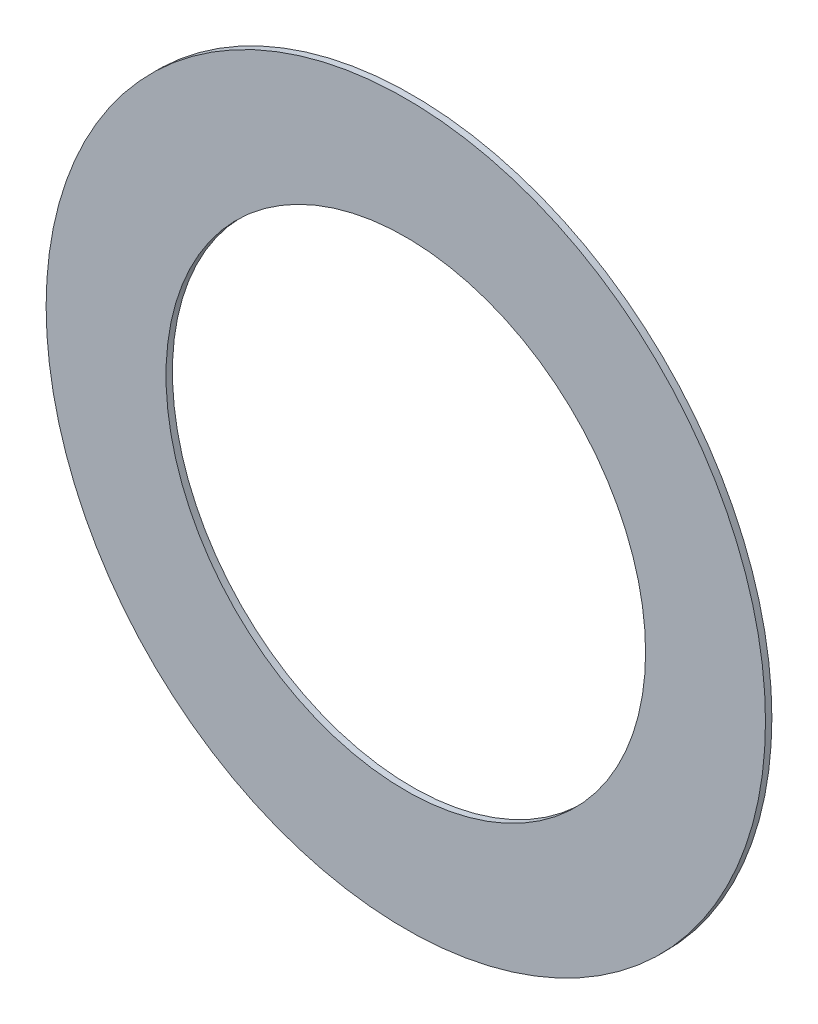
ISO-10303-21;
HEADER;
FILE_DESCRIPTION(('STEP AP214'),'2;1');
FILE_NAME('part.step','',(''),(''),'','','');
FILE_SCHEMA(('AUTOMOTIVE_DESIGN { 1 0 10303 214 1 1 1 1 }'));
ENDSEC;
DATA;
#1=APPLICATION_CONTEXT('core data for automotive mechanical design processes');
#2=APPLICATION_PROTOCOL_DEFINITION('international standard','automotive_design',2000,#1);
#3=PRODUCT_CONTEXT('',#1,'mechanical');
#4=PRODUCT('Part','Part','',(#3));
#5=PRODUCT_RELATED_PRODUCT_CATEGORY('part','',(#4));
#6=PRODUCT_DEFINITION_FORMATION('','',#4);
#7=PRODUCT_DEFINITION_CONTEXT('part definition',#1,'design');
#8=PRODUCT_DEFINITION('design','',#6,#7);
#9=PRODUCT_DEFINITION_SHAPE('','',#8);
#10=(LENGTH_UNIT() NAMED_UNIT(*) SI_UNIT(.MILLI.,.METRE.));
#11=(NAMED_UNIT(*) PLANE_ANGLE_UNIT() SI_UNIT($,.RADIAN.));
#12=(NAMED_UNIT(*) SI_UNIT($,.STERADIAN.) SOLID_ANGLE_UNIT());
#13=UNCERTAINTY_MEASURE_WITH_UNIT(LENGTH_MEASURE(1.E-05),#10,'distance_accuracy_value','');
#14=(GEOMETRIC_REPRESENTATION_CONTEXT(3) GLOBAL_UNCERTAINTY_ASSIGNED_CONTEXT((#13)) GLOBAL_UNIT_ASSIGNED_CONTEXT((#10,
#11,#12)) REPRESENTATION_CONTEXT('',''));
#15=CARTESIAN_POINT('',(0.,0.,0.));
#16=DIRECTION('',(0.,0.,1.));
#17=DIRECTION('',(1.,0.,0.));
#18=AXIS2_PLACEMENT_3D('',#15,#16,#17);
#19=CARTESIAN_POINT('',(0.,0.,0.));
#20=DIRECTION('',(0.,0.,1.));
#21=DIRECTION('',(1.,0.,0.));
#22=AXIS2_PLACEMENT_3D('',#19,#20,#21);
#23=PLANE('',#22);
#24=CARTESIAN_POINT('',(0.,0.,0.));
#25=DIRECTION('',(0.,0.,1.));
#26=DIRECTION('',(1.,0.,0.));
#27=AXIS2_PLACEMENT_3D('',#24,#25,#26);
#28=CIRCLE('',#27,9.525);
#29=CARTESIAN_POINT('',(9.525,0.,0.));
#30=VERTEX_POINT('',#29);
#31=EDGE_CURVE('E26',#30,#30,#28,.T.);
#32=ORIENTED_EDGE('',*,*,#31,.T.);
#33=EDGE_LOOP('',(#32));
#34=FACE_BOUND('',#33,.T.);
#35=CARTESIAN_POINT('',(0.,0.,0.));
#36=DIRECTION('',(0.,0.,1.));
#37=DIRECTION('',(1.,0.,0.));
#38=AXIS2_PLACEMENT_3D('',#35,#36,#37);
#39=CIRCLE('',#38,14.2875);
#40=CARTESIAN_POINT('',(14.2875,0.,0.));
#41=VERTEX_POINT('',#40);
#42=EDGE_CURVE('E17',#41,#41,#39,.T.);
#43=ORIENTED_EDGE('',*,*,#42,.F.);
#44=EDGE_LOOP('',(#43));
#45=FACE_BOUND('',#44,.T.);
#46=ADVANCED_FACE('F14',(#34,#45),#23,.F.);
#47=CARTESIAN_POINT('',(0.,0.,0.));
#48=DIRECTION('',(0.,0.,1.));
#49=DIRECTION('',(1.,0.,0.));
#50=AXIS2_PLACEMENT_3D('',#47,#48,#49);
#51=CYLINDRICAL_SURFACE('',#50,14.2875);
#52=ORIENTED_EDGE('',*,*,#42,.T.);
#53=EDGE_LOOP('',(#52));
#54=FACE_BOUND('',#53,.T.);
#55=CARTESIAN_POINT('',(0.,0.,0.254));
#56=DIRECTION('',(0.,0.,1.));
#57=DIRECTION('',(1.,0.,0.));
#58=AXIS2_PLACEMENT_3D('',#55,#56,#57);
#59=CIRCLE('',#58,14.2875);
#60=CARTESIAN_POINT('',(14.2875,0.,0.254));
#61=VERTEX_POINT('',#60);
#62=EDGE_CURVE('E21',#61,#61,#59,.T.);
#63=ORIENTED_EDGE('',*,*,#62,.F.);
#64=EDGE_LOOP('',(#63));
#65=FACE_BOUND('',#64,.T.);
#66=ADVANCED_FACE('F34',(#54,#65),#51,.T.);
#67=CARTESIAN_POINT('',(0.,0.,0.));
#68=DIRECTION('',(0.,0.,1.));
#69=DIRECTION('',(1.,0.,0.));
#70=AXIS2_PLACEMENT_3D('',#67,#68,#69);
#71=CYLINDRICAL_SURFACE('',#70,9.525);
#72=ORIENTED_EDGE('',*,*,#31,.F.);
#73=EDGE_LOOP('',(#72));
#74=FACE_BOUND('',#73,.T.);
#75=CARTESIAN_POINT('',(0.,0.,0.254));
#76=DIRECTION('',(0.,0.,1.));
#77=DIRECTION('',(1.,0.,0.));
#78=AXIS2_PLACEMENT_3D('',#75,#76,#77);
#79=CIRCLE('',#78,9.525);
#80=CARTESIAN_POINT('',(9.525,0.,0.254));
#81=VERTEX_POINT('',#80);
#82=EDGE_CURVE('E10',#81,#81,#79,.F.);
#83=ORIENTED_EDGE('',*,*,#82,.F.);
#84=EDGE_LOOP('',(#83));
#85=FACE_BOUND('',#84,.T.);
#86=ADVANCED_FACE('F42',(#74,#85),#71,.F.);
#87=CARTESIAN_POINT('',(0.,0.,0.254));
#88=DIRECTION('',(0.,0.,1.));
#89=DIRECTION('',(1.,0.,0.));
#90=AXIS2_PLACEMENT_3D('',#87,#88,#89);
#91=PLANE('',#90);
#92=ORIENTED_EDGE('',*,*,#82,.T.);
#93=EDGE_LOOP('',(#92));
#94=FACE_BOUND('',#93,.T.);
#95=ORIENTED_EDGE('',*,*,#62,.T.);
#96=EDGE_LOOP('',(#95));
#97=FACE_BOUND('',#96,.T.);
#98=ADVANCED_FACE('F43',(#94,#97),#91,.T.);
#99=CLOSED_SHELL('',(#46,#66,#86,#98));
#100=MANIFOLD_SOLID_BREP('B1',#99);
#101=ADVANCED_BREP_SHAPE_REPRESENTATION('',(#18,#100),#14);
#102=SHAPE_DEFINITION_REPRESENTATION(#9,#101);
ENDSEC;
END-ISO-10303-21;
